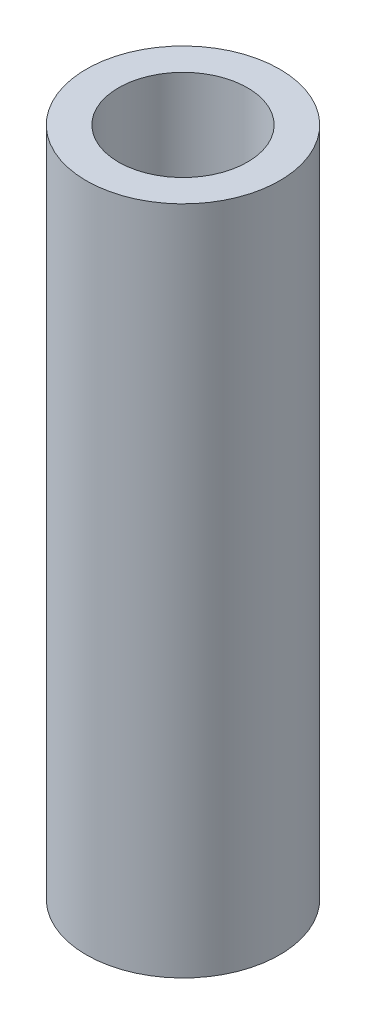
ISO-10303-21;
HEADER;
FILE_DESCRIPTION(('STEP AP214'),'2;1');
FILE_NAME('part.step','',(''),(''),'','','');
FILE_SCHEMA(('AUTOMOTIVE_DESIGN { 1 0 10303 214 1 1 1 1 }'));
ENDSEC;
DATA;
#1=APPLICATION_CONTEXT('core data for automotive mechanical design processes');
#2=APPLICATION_PROTOCOL_DEFINITION('international standard','automotive_design',2000,#1);
#3=PRODUCT_CONTEXT('',#1,'mechanical');
#4=PRODUCT('Part','Part','',(#3));
#5=PRODUCT_RELATED_PRODUCT_CATEGORY('part','',(#4));
#6=PRODUCT_DEFINITION_FORMATION('','',#4);
#7=PRODUCT_DEFINITION_CONTEXT('part definition',#1,'design');
#8=PRODUCT_DEFINITION('design','',#6,#7);
#9=PRODUCT_DEFINITION_SHAPE('','',#8);
#10=(LENGTH_UNIT() NAMED_UNIT(*) SI_UNIT(.MILLI.,.METRE.));
#11=(NAMED_UNIT(*) PLANE_ANGLE_UNIT() SI_UNIT($,.RADIAN.));
#12=(NAMED_UNIT(*) SI_UNIT($,.STERADIAN.) SOLID_ANGLE_UNIT());
#13=UNCERTAINTY_MEASURE_WITH_UNIT(LENGTH_MEASURE(1.E-05),#10,'distance_accuracy_value','');
#14=(GEOMETRIC_REPRESENTATION_CONTEXT(3) GLOBAL_UNCERTAINTY_ASSIGNED_CONTEXT((#13)) GLOBAL_UNIT_ASSIGNED_CONTEXT((#10,
#11,#12)) REPRESENTATION_CONTEXT('',''));
#15=CARTESIAN_POINT('',(0.,0.,0.));
#16=DIRECTION('',(0.,0.,1.));
#17=DIRECTION('',(1.,0.,0.));
#18=AXIS2_PLACEMENT_3D('',#15,#16,#17);
#19=CARTESIAN_POINT('',(0.,-33.02,0.));
#20=DIRECTION('',(0.,1.,0.));
#21=DIRECTION('',(0.,0.,1.));
#22=AXIS2_PLACEMENT_3D('',#19,#20,#21);
#23=CYLINDRICAL_SURFACE('',#22,4.7625);
#24=CARTESIAN_POINT('',(0.,-33.02,0.));
#25=DIRECTION('',(0.,1.,0.));
#26=DIRECTION('',(0.,0.,1.));
#27=AXIS2_PLACEMENT_3D('',#24,#25,#26);
#28=CIRCLE('',#27,4.7625);
#29=CARTESIAN_POINT('',(0.,-33.02,4.7625));
#30=VERTEX_POINT('',#29);
#31=EDGE_CURVE('E10',#30,#30,#28,.T.);
#32=ORIENTED_EDGE('',*,*,#31,.T.);
#33=EDGE_LOOP('',(#32));
#34=FACE_BOUND('',#33,.T.);
#35=CARTESIAN_POINT('',(0.,0.,0.));
#36=DIRECTION('',(0.,1.,0.));
#37=DIRECTION('',(0.,0.,1.));
#38=AXIS2_PLACEMENT_3D('',#35,#36,#37);
#39=CIRCLE('',#38,4.7625);
#40=CARTESIAN_POINT('',(0.,0.,4.7625));
#41=VERTEX_POINT('',#40);
#42=EDGE_CURVE('E37',#41,#41,#39,.T.);
#43=ORIENTED_EDGE('',*,*,#42,.F.);
#44=EDGE_LOOP('',(#43));
#45=FACE_BOUND('',#44,.T.);
#46=ADVANCED_FACE('F34',(#34,#45),#23,.T.);
#47=CARTESIAN_POINT('',(0.,-33.02,0.));
#48=DIRECTION('',(0.,1.,0.));
#49=DIRECTION('',(0.,0.,1.));
#50=AXIS2_PLACEMENT_3D('',#47,#48,#49);
#51=PLANE('',#50);
#52=CARTESIAN_POINT('',(0.,-33.02,0.));
#53=DIRECTION('',(0.,1.,0.));
#54=DIRECTION('',(0.,0.,1.));
#55=AXIS2_PLACEMENT_3D('',#52,#53,#54);
#56=CIRCLE('',#55,3.175);
#57=CARTESIAN_POINT('',(0.,-33.02,3.175));
#58=VERTEX_POINT('',#57);
#59=EDGE_CURVE('E44',#58,#58,#56,.T.);
#60=ORIENTED_EDGE('',*,*,#59,.T.);
#61=EDGE_LOOP('',(#60));
#62=FACE_BOUND('',#61,.T.);
#63=ORIENTED_EDGE('',*,*,#31,.F.);
#64=EDGE_LOOP('',(#63));
#65=FACE_BOUND('',#64,.T.);
#66=ADVANCED_FACE('F52',(#62,#65),#51,.F.);
#67=CARTESIAN_POINT('',(0.,0.,0.));
#68=DIRECTION('',(0.,1.,0.));
#69=DIRECTION('',(0.,0.,1.));
#70=AXIS2_PLACEMENT_3D('',#67,#68,#69);
#71=PLANE('',#70);
#72=CARTESIAN_POINT('',(0.,0.,0.));
#73=DIRECTION('',(0.,1.,0.));
#74=DIRECTION('',(0.,0.,1.));
#75=AXIS2_PLACEMENT_3D('',#72,#73,#74);
#76=CIRCLE('',#75,3.175);
#77=CARTESIAN_POINT('',(0.,0.,3.175));
#78=VERTEX_POINT('',#77);
#79=EDGE_CURVE('E46',#78,#78,#76,.T.);
#80=ORIENTED_EDGE('',*,*,#79,.F.);
#81=EDGE_LOOP('',(#80));
#82=FACE_BOUND('',#81,.T.);
#83=ORIENTED_EDGE('',*,*,#42,.T.);
#84=EDGE_LOOP('',(#83));
#85=FACE_BOUND('',#84,.T.);
#86=ADVANCED_FACE('F58',(#82,#85),#71,.T.);
#87=CARTESIAN_POINT('',(0.,-33.02,0.));
#88=DIRECTION('',(0.,1.,0.));
#89=DIRECTION('',(0.,0.,1.));
#90=AXIS2_PLACEMENT_3D('',#87,#88,#89);
#91=CYLINDRICAL_SURFACE('',#90,3.175);
#92=ORIENTED_EDGE('',*,*,#59,.F.);
#93=EDGE_LOOP('',(#92));
#94=FACE_BOUND('',#93,.T.);
#95=ORIENTED_EDGE('',*,*,#79,.T.);
#96=EDGE_LOOP('',(#95));
#97=FACE_BOUND('',#96,.T.);
#98=ADVANCED_FACE('F55',(#94,#97),#91,.F.);
#99=CLOSED_SHELL('',(#46,#66,#86,#98));
#100=MANIFOLD_SOLID_BREP('B2',#99);
#101=ADVANCED_BREP_SHAPE_REPRESENTATION('',(#18,#100),#14);
#102=SHAPE_DEFINITION_REPRESENTATION(#9,#101);
ENDSEC;
END-ISO-10303-21;
